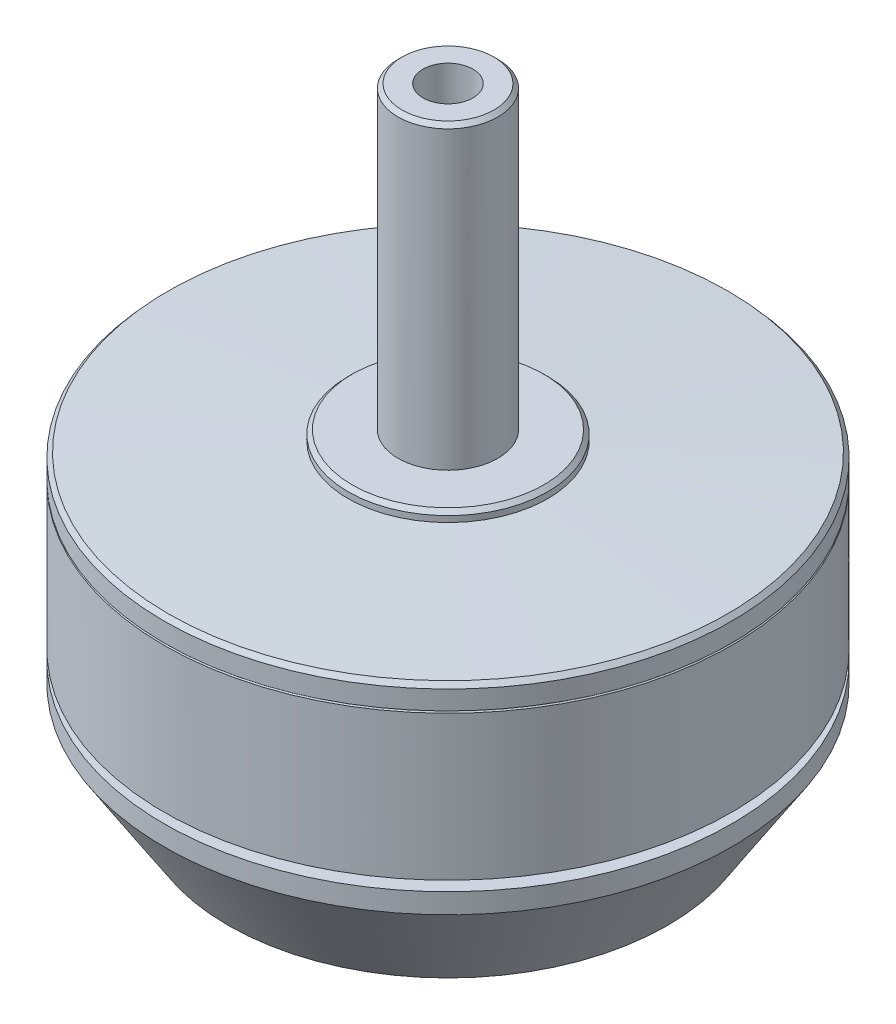
ISO-10303-21;
HEADER;
FILE_DESCRIPTION(('STEP AP214'),'2;1');
FILE_NAME('part.step','',(''),(''),'','','');
FILE_SCHEMA(('AUTOMOTIVE_DESIGN { 1 0 10303 214 1 1 1 1 }'));
ENDSEC;
DATA;
#1=APPLICATION_CONTEXT('core data for automotive mechanical design processes');
#2=APPLICATION_PROTOCOL_DEFINITION('international standard','automotive_design',2000,#1);
#3=PRODUCT_CONTEXT('',#1,'mechanical');
#4=PRODUCT('Part','Part','',(#3));
#5=PRODUCT_RELATED_PRODUCT_CATEGORY('part','',(#4));
#6=PRODUCT_DEFINITION_FORMATION('','',#4);
#7=PRODUCT_DEFINITION_CONTEXT('part definition',#1,'design');
#8=PRODUCT_DEFINITION('design','',#6,#7);
#9=PRODUCT_DEFINITION_SHAPE('','',#8);
#10=(LENGTH_UNIT() NAMED_UNIT(*) SI_UNIT(.MILLI.,.METRE.));
#11=(NAMED_UNIT(*) PLANE_ANGLE_UNIT() SI_UNIT($,.RADIAN.));
#12=(NAMED_UNIT(*) SI_UNIT($,.STERADIAN.) SOLID_ANGLE_UNIT());
#13=UNCERTAINTY_MEASURE_WITH_UNIT(LENGTH_MEASURE(1.E-05),#10,'distance_accuracy_value','');
#14=(GEOMETRIC_REPRESENTATION_CONTEXT(3) GLOBAL_UNCERTAINTY_ASSIGNED_CONTEXT((#13)) GLOBAL_UNIT_ASSIGNED_CONTEXT((#10,
#11,#12)) REPRESENTATION_CONTEXT('',''));
#15=CARTESIAN_POINT('',(0.,0.,0.));
#16=DIRECTION('',(0.,0.,1.));
#17=DIRECTION('',(1.,0.,0.));
#18=AXIS2_PLACEMENT_3D('',#15,#16,#17);
#19=CARTESIAN_POINT('',(0.,0.750762332576101,0.));
#20=DIRECTION('',(0.,-1.,0.));
#21=DIRECTION('',(0.,0.,-1.));
#22=AXIS2_PLACEMENT_3D('',#19,#20,#21);
#23=CYLINDRICAL_SURFACE('',#22,14.1999999999977);
#24=CARTESIAN_POINT('',(0.,14.7881936335998,0.));
#25=DIRECTION('',(0.,1.,0.));
#26=DIRECTION('',(0.,0.,1.));
#27=AXIS2_PLACEMENT_3D('',#24,#25,#26);
#28=CIRCLE('',#27,14.1999999999977);
#29=CARTESIAN_POINT('',(0.,14.7881936335998,14.1999999999977));
#30=VERTEX_POINT('',#29);
#31=EDGE_CURVE('E98',#30,#30,#28,.F.);
#32=ORIENTED_EDGE('',*,*,#31,.T.);
#33=EDGE_LOOP('',(#32));
#34=FACE_BOUND('',#33,.T.);
#35=CARTESIAN_POINT('',(0.,13.8378018935646,0.));
#36=DIRECTION('',(0.,-1.,0.));
#37=DIRECTION('',(0.,0.,-1.));
#38=AXIS2_PLACEMENT_3D('',#35,#36,#37);
#39=CIRCLE('',#38,14.1999999999977);
#40=CARTESIAN_POINT('',(0.,13.8378018935646,-14.1999999999977));
#41=VERTEX_POINT('',#40);
#42=EDGE_CURVE('E37',#41,#41,#39,.F.);
#43=ORIENTED_EDGE('',*,*,#42,.T.);
#44=EDGE_LOOP('',(#43));
#45=FACE_BOUND('',#44,.T.);
#46=ADVANCED_FACE('F33',(#34,#45),#23,.T.);
#47=CARTESIAN_POINT('',(0.,19.0597983341897,0.));
#48=DIRECTION('',(0.,1.,0.));
#49=DIRECTION('',(0.,0.,1.));
#50=AXIS2_PLACEMENT_3D('',#47,#48,#49);
#51=PLANE('',#50);
#52=CARTESIAN_POINT('',(0.,19.0597983341897,0.));
#53=DIRECTION('',(0.,-1.,0.));
#54=DIRECTION('',(0.,0.,-1.));
#55=AXIS2_PLACEMENT_3D('',#52,#53,#54);
#56=CIRCLE('',#55,1.25);
#57=CARTESIAN_POINT('',(0.,19.0597983341897,-1.25));
#58=VERTEX_POINT('',#57);
#59=EDGE_CURVE('E54',#58,#58,#56,.T.);
#60=ORIENTED_EDGE('',*,*,#59,.F.);
#61=EDGE_LOOP('',(#60));
#62=FACE_BOUND('',#61,.T.);
#63=ADVANCED_FACE('F126',(#62),#51,.T.);
#64=CARTESIAN_POINT('',(0.,15.,0.));
#65=DIRECTION('',(0.,-1.,0.));
#66=DIRECTION('',(0.,0.,-1.));
#67=AXIS2_PLACEMENT_3D('',#64,#65,#66);
#68=CONICAL_SURFACE('',#67,14.1999999999977,1.51650191488658);
#69=CARTESIAN_POINT('',(0.,15.0108535480486,0.));
#70=DIRECTION('',(0.,1.,0.));
#71=DIRECTION('',(0.,0.,1.));
#72=AXIS2_PLACEMENT_3D('',#69,#70,#71);
#73=CIRCLE('',#72,14.0002947159045);
#74=CARTESIAN_POINT('',(0.,15.0108535480486,14.0002947159045));
#75=VERTEX_POINT('',#74);
#76=EDGE_CURVE('E101',#75,#75,#73,.T.);
#77=ORIENTED_EDGE('',*,*,#76,.T.);
#78=EDGE_LOOP('',(#77));
#79=FACE_BOUND('',#78,.T.);
#80=CARTESIAN_POINT('',(0.,15.5,0.));
#81=DIRECTION('',(0.,-1.,0.));
#82=DIRECTION('',(0.,0.,-1.));
#83=AXIS2_PLACEMENT_3D('',#80,#81,#82);
#84=CIRCLE('',#83,5.);
#85=CARTESIAN_POINT('',(0.,15.5,-5.));
#86=VERTEX_POINT('',#85);
#87=EDGE_CURVE('E68',#86,#86,#84,.T.);
#88=ORIENTED_EDGE('',*,*,#87,.T.);
#89=EDGE_LOOP('',(#88));
#90=FACE_BOUND('',#89,.T.);
#91=ADVANCED_FACE('F121',(#79,#90),#68,.T.);
#92=CARTESIAN_POINT('',(0.,0.750762332576101,0.));
#93=DIRECTION('',(0.,-1.,0.));
#94=DIRECTION('',(0.,0.,-1.));
#95=AXIS2_PLACEMENT_3D('',#92,#93,#94);
#96=CYLINDRICAL_SURFACE('',#95,5.);
#97=CARTESIAN_POINT('',(0.,15.8,0.));
#98=DIRECTION('',(0.,1.,0.));
#99=DIRECTION('',(0.,0.,1.));
#100=AXIS2_PLACEMENT_3D('',#97,#98,#99);
#101=CIRCLE('',#100,5.);
#102=CARTESIAN_POINT('',(0.,15.8,5.));
#103=VERTEX_POINT('',#102);
#104=EDGE_CURVE('E104',#103,#103,#101,.F.);
#105=ORIENTED_EDGE('',*,*,#104,.T.);
#106=EDGE_LOOP('',(#105));
#107=FACE_BOUND('',#106,.T.);
#108=ORIENTED_EDGE('',*,*,#87,.F.);
#109=EDGE_LOOP('',(#108));
#110=FACE_BOUND('',#109,.T.);
#111=ADVANCED_FACE('F118',(#107,#110),#96,.T.);
#112=CARTESIAN_POINT('',(5.,16.,0.));
#113=DIRECTION('',(0.,1.,0.));
#114=DIRECTION('',(0.,0.,1.));
#115=AXIS2_PLACEMENT_3D('',#112,#113,#114);
#116=PLANE('',#115);
#117=CARTESIAN_POINT('',(0.,16.,0.));
#118=DIRECTION('',(0.,1.,0.));
#119=DIRECTION('',(0.,0.,1.));
#120=AXIS2_PLACEMENT_3D('',#117,#118,#119);
#121=CIRCLE('',#120,4.80000000000001);
#122=CARTESIAN_POINT('',(0.,16.,4.80000000000001));
#123=VERTEX_POINT('',#122);
#124=EDGE_CURVE('E46',#123,#123,#121,.T.);
#125=ORIENTED_EDGE('',*,*,#124,.T.);
#126=EDGE_LOOP('',(#125));
#127=FACE_BOUND('',#126,.T.);
#128=CARTESIAN_POINT('',(0.,16.,0.));
#129=DIRECTION('',(0.,-1.,0.));
#130=DIRECTION('',(0.,0.,-1.));
#131=AXIS2_PLACEMENT_3D('',#128,#129,#130);
#132=CIRCLE('',#131,2.5);
#133=CARTESIAN_POINT('',(0.,16.,-2.5));
#134=VERTEX_POINT('',#133);
#135=EDGE_CURVE('E63',#134,#134,#132,.T.);
#136=ORIENTED_EDGE('',*,*,#135,.T.);
#137=EDGE_LOOP('',(#136));
#138=FACE_BOUND('',#137,.T.);
#139=ADVANCED_FACE('F109',(#127,#138),#116,.T.);
#140=CARTESIAN_POINT('',(0.,0.750762332576101,0.));
#141=DIRECTION('',(0.,-1.,0.));
#142=DIRECTION('',(0.,0.,-1.));
#143=AXIS2_PLACEMENT_3D('',#140,#141,#142);
#144=CYLINDRICAL_SURFACE('',#143,2.5);
#145=CARTESIAN_POINT('',(0.,30.8,0.));
#146=DIRECTION('',(0.,1.,0.));
#147=DIRECTION('',(0.,0.,1.));
#148=AXIS2_PLACEMENT_3D('',#145,#146,#147);
#149=CIRCLE('',#148,2.5);
#150=CARTESIAN_POINT('',(0.,30.8,2.5));
#151=VERTEX_POINT('',#150);
#152=EDGE_CURVE('E41',#151,#151,#149,.F.);
#153=ORIENTED_EDGE('',*,*,#152,.T.);
#154=EDGE_LOOP('',(#153));
#155=FACE_BOUND('',#154,.T.);
#156=ORIENTED_EDGE('',*,*,#135,.F.);
#157=EDGE_LOOP('',(#156));
#158=FACE_BOUND('',#157,.T.);
#159=ADVANCED_FACE('F210',(#155,#158),#144,.T.);
#160=CARTESIAN_POINT('',(1.25,31.,0.));
#161=DIRECTION('',(0.,1.,0.));
#162=DIRECTION('',(0.,0.,1.));
#163=AXIS2_PLACEMENT_3D('',#160,#161,#162);
#164=PLANE('',#163);
#165=CARTESIAN_POINT('',(0.,31.,0.));
#166=DIRECTION('',(0.,1.,0.));
#167=DIRECTION('',(0.,0.,1.));
#168=AXIS2_PLACEMENT_3D('',#165,#166,#167);
#169=CIRCLE('',#168,2.3);
#170=CARTESIAN_POINT('',(0.,31.,2.3));
#171=VERTEX_POINT('',#170);
#172=EDGE_CURVE('E10',#171,#171,#169,.T.);
#173=ORIENTED_EDGE('',*,*,#172,.T.);
#174=EDGE_LOOP('',(#173));
#175=FACE_BOUND('',#174,.T.);
#176=CARTESIAN_POINT('',(0.,31.,0.));
#177=DIRECTION('',(0.,-1.,0.));
#178=DIRECTION('',(0.,0.,-1.));
#179=AXIS2_PLACEMENT_3D('',#176,#177,#178);
#180=CIRCLE('',#179,1.25);
#181=CARTESIAN_POINT('',(0.,31.,-1.25));
#182=VERTEX_POINT('',#181);
#183=EDGE_CURVE('E58',#182,#182,#180,.T.);
#184=ORIENTED_EDGE('',*,*,#183,.T.);
#185=EDGE_LOOP('',(#184));
#186=FACE_BOUND('',#185,.T.);
#187=ADVANCED_FACE('F202',(#175,#186),#164,.T.);
#188=CARTESIAN_POINT('',(0.,0.750762332576101,0.));
#189=DIRECTION('',(0.,-1.,0.));
#190=DIRECTION('',(0.,0.,-1.));
#191=AXIS2_PLACEMENT_3D('',#188,#189,#190);
#192=CYLINDRICAL_SURFACE('',#191,1.25);
#193=ORIENTED_EDGE('',*,*,#59,.T.);
#194=EDGE_LOOP('',(#193));
#195=FACE_BOUND('',#194,.T.);
#196=ORIENTED_EDGE('',*,*,#183,.F.);
#197=EDGE_LOOP('',(#196));
#198=FACE_BOUND('',#197,.T.);
#199=ADVANCED_FACE('F197',(#195,#198),#192,.F.);
#200=CARTESIAN_POINT('',(0.,14.7881936335998,0.));
#201=DIRECTION('',(0.,-1.,0.));
#202=DIRECTION('',(0.,0.,-1.));
#203=AXIS2_PLACEMENT_3D('',#200,#201,#202);
#204=CONICAL_SURFACE('',#203,14.1999999999977,0.731103751489135);
#205=ORIENTED_EDGE('',*,*,#76,.F.);
#206=EDGE_LOOP('',(#205));
#207=FACE_BOUND('',#206,.T.);
#208=ORIENTED_EDGE('',*,*,#31,.F.);
#209=EDGE_LOOP('',(#208));
#210=FACE_BOUND('',#209,.T.);
#211=ADVANCED_FACE('F115',(#207,#210),#204,.T.);
#212=CARTESIAN_POINT('',(0.,15.8,0.));
#213=DIRECTION('',(0.,-1.,0.));
#214=DIRECTION('',(0.,0.,-1.));
#215=AXIS2_PLACEMENT_3D('',#212,#213,#214);
#216=CONICAL_SURFACE('',#215,5.,0.785398163397446);
#217=ORIENTED_EDGE('',*,*,#124,.F.);
#218=EDGE_LOOP('',(#217));
#219=FACE_BOUND('',#218,.T.);
#220=ORIENTED_EDGE('',*,*,#104,.F.);
#221=EDGE_LOOP('',(#220));
#222=FACE_BOUND('',#221,.T.);
#223=ADVANCED_FACE('F112',(#219,#222),#216,.T.);
#224=CARTESIAN_POINT('',(0.,30.8,0.));
#225=DIRECTION('',(0.,-1.,0.));
#226=DIRECTION('',(0.,0.,-1.));
#227=AXIS2_PLACEMENT_3D('',#224,#225,#226);
#228=CONICAL_SURFACE('',#227,2.5,0.785398163397461);
#229=ORIENTED_EDGE('',*,*,#172,.F.);
#230=EDGE_LOOP('',(#229));
#231=FACE_BOUND('',#230,.T.);
#232=ORIENTED_EDGE('',*,*,#152,.F.);
#233=EDGE_LOOP('',(#232));
#234=FACE_BOUND('',#233,.T.);
#235=ADVANCED_FACE('F35',(#231,#234),#228,.T.);
#236=CARTESIAN_POINT('',(0.,13.7881936335998,0.));
#237=DIRECTION('',(0.,1.,0.));
#238=DIRECTION('',(0.,0.,1.));
#239=AXIS2_PLACEMENT_3D('',#236,#237,#238);
#240=TOROIDAL_SURFACE('',#239,14.1937533574386,0.0499999999999988);
#241=ORIENTED_EDGE('',*,*,#42,.F.);
#242=EDGE_LOOP('',(#241));
#243=FACE_BOUND('',#242,.T.);
#244=CARTESIAN_POINT('',(0.,13.7385853736349,0.));
#245=DIRECTION('',(0.,1.,0.));
#246=DIRECTION('',(0.,0.,1.));
#247=AXIS2_PLACEMENT_3D('',#244,#245,#246);
#248=CIRCLE('',#247,14.1999999999977);
#249=CARTESIAN_POINT('',(0.,13.7385853736349,14.1999999999977));
#250=VERTEX_POINT('',#249);
#251=EDGE_CURVE('E49',#250,#250,#248,.F.);
#252=ORIENTED_EDGE('',*,*,#251,.F.);
#253=EDGE_LOOP('',(#252));
#254=FACE_BOUND('',#253,.T.);
#255=ADVANCED_FACE('F193',(#243,#254),#240,.F.);
#256=CARTESIAN_POINT('',(6.,0.750762332576101,0.));
#257=DIRECTION('',(0.,-1.,0.));
#258=DIRECTION('',(0.,0.,-1.));
#259=AXIS2_PLACEMENT_3D('',#256,#257,#258);
#260=PLANE('',#259);
#261=CARTESIAN_POINT('',(0.,0.750762332576101,0.));
#262=DIRECTION('',(0.,-1.,0.));
#263=DIRECTION('',(0.,0.,-1.));
#264=AXIS2_PLACEMENT_3D('',#261,#262,#263);
#265=CIRCLE('',#264,6.);
#266=CARTESIAN_POINT('',(0.,0.750762332576101,-6.));
#267=VERTEX_POINT('',#266);
#268=EDGE_CURVE('E89',#267,#267,#265,.T.);
#269=ORIENTED_EDGE('',*,*,#268,.T.);
#270=EDGE_LOOP('',(#269));
#271=FACE_BOUND('',#270,.T.);
#272=ADVANCED_FACE('F190',(#271),#260,.T.);
#273=CARTESIAN_POINT('',(0.,0.750762332576101,0.));
#274=DIRECTION('',(0.,-1.,0.));
#275=DIRECTION('',(0.,0.,-1.));
#276=AXIS2_PLACEMENT_3D('',#273,#274,#275);
#277=CYLINDRICAL_SURFACE('',#276,6.);
#278=CARTESIAN_POINT('',(0.,0.200000000000003,0.));
#279=DIRECTION('',(0.,-1.,0.));
#280=DIRECTION('',(0.,0.,-1.));
#281=AXIS2_PLACEMENT_3D('',#278,#279,#280);
#282=CIRCLE('',#281,6.);
#283=CARTESIAN_POINT('',(0.,0.200000000000003,-6.));
#284=VERTEX_POINT('',#283);
#285=EDGE_CURVE('E92',#284,#284,#282,.T.);
#286=ORIENTED_EDGE('',*,*,#285,.T.);
#287=EDGE_LOOP('',(#286));
#288=FACE_BOUND('',#287,.T.);
#289=ORIENTED_EDGE('',*,*,#268,.F.);
#290=EDGE_LOOP('',(#289));
#291=FACE_BOUND('',#290,.T.);
#292=ADVANCED_FACE('F184',(#288,#291),#277,.F.);
#293=CARTESIAN_POINT('',(0.,0.200000000000003,0.));
#294=DIRECTION('',(0.,-1.,0.));
#295=DIRECTION('',(0.,0.,-1.));
#296=AXIS2_PLACEMENT_3D('',#293,#294,#295);
#297=CONICAL_SURFACE('',#296,6.,0.78539816339745);
#298=CARTESIAN_POINT('',(0.,0.,0.));
#299=DIRECTION('',(0.,-1.,0.));
#300=DIRECTION('',(0.,0.,-1.));
#301=AXIS2_PLACEMENT_3D('',#298,#299,#300);
#302=CIRCLE('',#301,6.2);
#303=CARTESIAN_POINT('',(0.,0.,-6.2));
#304=VERTEX_POINT('',#303);
#305=EDGE_CURVE('E95',#304,#304,#302,.F.);
#306=ORIENTED_EDGE('',*,*,#305,.F.);
#307=EDGE_LOOP('',(#306));
#308=FACE_BOUND('',#307,.T.);
#309=ORIENTED_EDGE('',*,*,#285,.F.);
#310=EDGE_LOOP('',(#309));
#311=FACE_BOUND('',#310,.T.);
#312=ADVANCED_FACE('F178',(#308,#311),#297,.F.);
#313=CARTESIAN_POINT('',(6.,0.,0.));
#314=DIRECTION('',(0.,-1.,0.));
#315=DIRECTION('',(0.,0.,-1.));
#316=AXIS2_PLACEMENT_3D('',#313,#314,#315);
#317=PLANE('',#316);
#318=ORIENTED_EDGE('',*,*,#305,.T.);
#319=EDGE_LOOP('',(#318));
#320=FACE_BOUND('',#319,.T.);
#321=CARTESIAN_POINT('',(0.,0.,0.));
#322=DIRECTION('',(0.,-1.,0.));
#323=DIRECTION('',(0.,0.,-1.));
#324=AXIS2_PLACEMENT_3D('',#321,#322,#323);
#325=CIRCLE('',#324,11.);
#326=CARTESIAN_POINT('',(0.,0.,-11.));
#327=VERTEX_POINT('',#326);
#328=EDGE_CURVE('E86',#327,#327,#325,.T.);
#329=ORIENTED_EDGE('',*,*,#328,.T.);
#330=EDGE_LOOP('',(#329));
#331=FACE_BOUND('',#330,.T.);
#332=ADVANCED_FACE('F173',(#320,#331),#317,.T.);
#333=CARTESIAN_POINT('',(0.,0.,0.));
#334=DIRECTION('',(0.,1.,0.));
#335=DIRECTION('',(0.,0.,1.));
#336=AXIS2_PLACEMENT_3D('',#333,#334,#335);
#337=CONICAL_SURFACE('',#336,11.,0.569313191100336);
#338=CARTESIAN_POINT('',(0.,5.,0.));
#339=DIRECTION('',(0.,-1.,0.));
#340=DIRECTION('',(0.,0.,-1.));
#341=AXIS2_PLACEMENT_3D('',#338,#339,#340);
#342=CIRCLE('',#341,14.1999999999977);
#343=CARTESIAN_POINT('',(0.,5.,-14.1999999999977));
#344=VERTEX_POINT('',#343);
#345=EDGE_CURVE('E83',#344,#344,#342,.T.);
#346=ORIENTED_EDGE('',*,*,#345,.T.);
#347=EDGE_LOOP('',(#346));
#348=FACE_BOUND('',#347,.T.);
#349=ORIENTED_EDGE('',*,*,#328,.F.);
#350=EDGE_LOOP('',(#349));
#351=FACE_BOUND('',#350,.T.);
#352=ADVANCED_FACE('F167',(#348,#351),#337,.T.);
#353=CARTESIAN_POINT('',(0.,0.750762332576101,0.));
#354=DIRECTION('',(0.,-1.,0.));
#355=DIRECTION('',(0.,0.,-1.));
#356=AXIS2_PLACEMENT_3D('',#353,#354,#355);
#357=CYLINDRICAL_SURFACE('',#356,14.1999999999977);
#358=CARTESIAN_POINT('',(0.,6.,0.));
#359=DIRECTION('',(0.,-1.,0.));
#360=DIRECTION('',(0.,0.,-1.));
#361=AXIS2_PLACEMENT_3D('',#358,#359,#360);
#362=CIRCLE('',#361,14.1999999999977);
#363=CARTESIAN_POINT('',(0.,6.,-14.1999999999977));
#364=VERTEX_POINT('',#363);
#365=EDGE_CURVE('E80',#364,#364,#362,.T.);
#366=ORIENTED_EDGE('',*,*,#365,.T.);
#367=EDGE_LOOP('',(#366));
#368=FACE_BOUND('',#367,.T.);
#369=ORIENTED_EDGE('',*,*,#345,.F.);
#370=EDGE_LOOP('',(#369));
#371=FACE_BOUND('',#370,.T.);
#372=ADVANCED_FACE('F161',(#368,#371),#357,.T.);
#373=CARTESIAN_POINT('',(14.1999999999977,6.,0.));
#374=DIRECTION('',(0.,1.,0.));
#375=DIRECTION('',(0.,0.,1.));
#376=AXIS2_PLACEMENT_3D('',#373,#374,#375);
#377=PLANE('',#376);
#378=CARTESIAN_POINT('',(0.,6.,0.));
#379=DIRECTION('',(0.,-1.,0.));
#380=DIRECTION('',(0.,0.,-1.));
#381=AXIS2_PLACEMENT_3D('',#378,#379,#380);
#382=CIRCLE('',#381,11.);
#383=CARTESIAN_POINT('',(0.,6.,-11.));
#384=VERTEX_POINT('',#383);
#385=EDGE_CURVE('E77',#384,#384,#382,.T.);
#386=ORIENTED_EDGE('',*,*,#385,.T.);
#387=EDGE_LOOP('',(#386));
#388=FACE_BOUND('',#387,.T.);
#389=ORIENTED_EDGE('',*,*,#365,.F.);
#390=EDGE_LOOP('',(#389));
#391=FACE_BOUND('',#390,.T.);
#392=ADVANCED_FACE('F155',(#388,#391),#377,.T.);
#393=CARTESIAN_POINT('',(0.,0.750762332576101,0.));
#394=DIRECTION('',(0.,-1.,0.));
#395=DIRECTION('',(0.,0.,-1.));
#396=AXIS2_PLACEMENT_3D('',#393,#394,#395);
#397=CYLINDRICAL_SURFACE('',#396,11.);
#398=CARTESIAN_POINT('',(0.,6.5,0.));
#399=DIRECTION('',(0.,-1.,0.));
#400=DIRECTION('',(0.,0.,-1.));
#401=AXIS2_PLACEMENT_3D('',#398,#399,#400);
#402=CIRCLE('',#401,11.);
#403=CARTESIAN_POINT('',(0.,6.5,-11.));
#404=VERTEX_POINT('',#403);
#405=EDGE_CURVE('E74',#404,#404,#402,.T.);
#406=ORIENTED_EDGE('',*,*,#405,.T.);
#407=EDGE_LOOP('',(#406));
#408=FACE_BOUND('',#407,.T.);
#409=ORIENTED_EDGE('',*,*,#385,.F.);
#410=EDGE_LOOP('',(#409));
#411=FACE_BOUND('',#410,.T.);
#412=ADVANCED_FACE('F147',(#408,#411),#397,.T.);
#413=CARTESIAN_POINT('',(14.1999999999977,6.5,0.));
#414=DIRECTION('',(0.,-1.,0.));
#415=DIRECTION('',(0.,0.,-1.));
#416=AXIS2_PLACEMENT_3D('',#413,#414,#415);
#417=PLANE('',#416);
#418=CARTESIAN_POINT('',(0.,6.5,0.));
#419=DIRECTION('',(0.,-1.,0.));
#420=DIRECTION('',(0.,0.,-1.));
#421=AXIS2_PLACEMENT_3D('',#418,#419,#420);
#422=CIRCLE('',#421,14.1999999999977);
#423=CARTESIAN_POINT('',(0.,6.5,-14.1999999999977));
#424=VERTEX_POINT('',#423);
#425=EDGE_CURVE('E71',#424,#424,#422,.T.);
#426=ORIENTED_EDGE('',*,*,#425,.T.);
#427=EDGE_LOOP('',(#426));
#428=FACE_BOUND('',#427,.T.);
#429=ORIENTED_EDGE('',*,*,#405,.F.);
#430=EDGE_LOOP('',(#429));
#431=FACE_BOUND('',#430,.T.);
#432=ADVANCED_FACE('F142',(#428,#431),#417,.T.);
#433=ORIENTED_EDGE('',*,*,#425,.F.);
#434=EDGE_LOOP('',(#433));
#435=FACE_BOUND('',#434,.T.);
#436=ORIENTED_EDGE('',*,*,#251,.T.);
#437=EDGE_LOOP('',(#436));
#438=FACE_BOUND('',#437,.T.);
#439=ADVANCED_FACE('F137',(#435,#438),#23,.T.);
#440=CLOSED_SHELL('',(#46,#63,#91,#111,#139,#159,#187,#199,#211,#223,#235,#255,#272,#292,#312,
#332,#352,#372,#392,#412,#432,#439));
#441=MANIFOLD_SOLID_BREP('B2',#440);
#442=ADVANCED_BREP_SHAPE_REPRESENTATION('',(#18,#441),#14);
#443=SHAPE_DEFINITION_REPRESENTATION(#9,#442);
ENDSEC;
END-ISO-10303-21;
